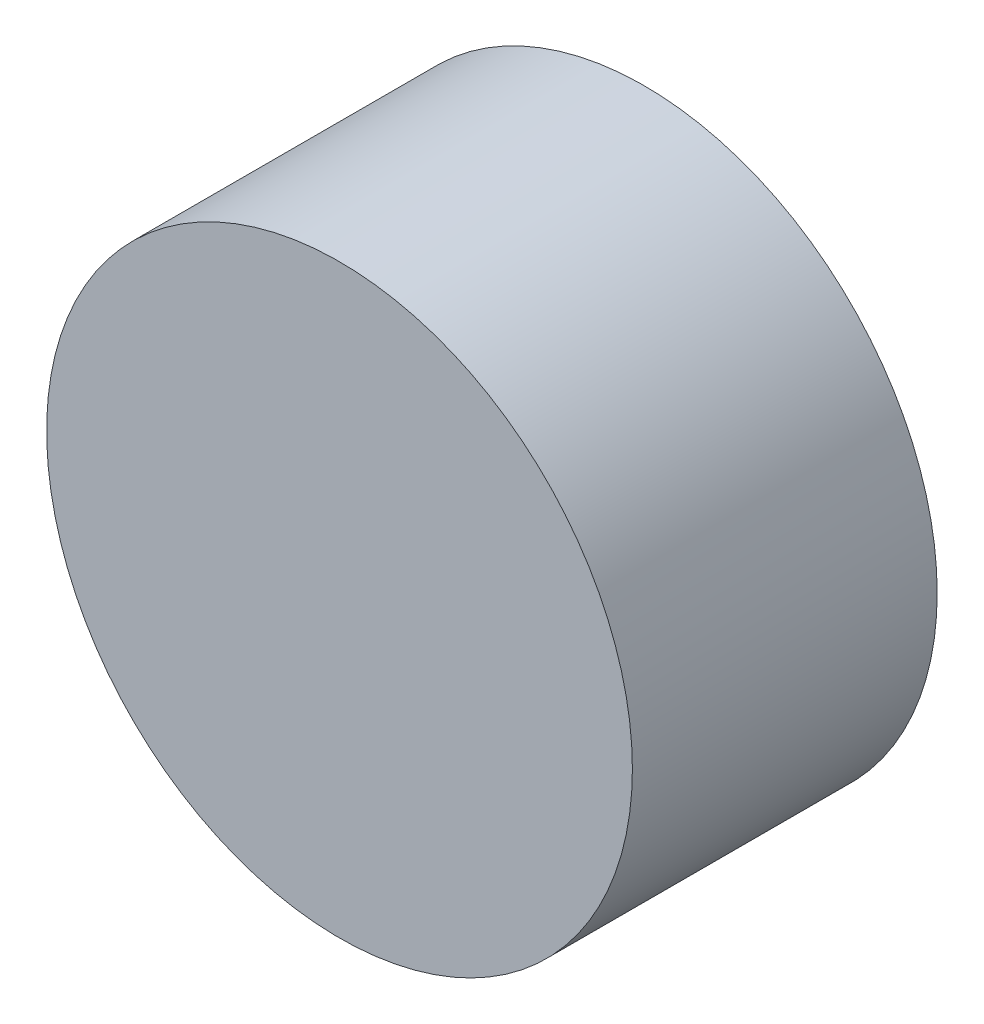
ISO-10303-21;
HEADER;
FILE_DESCRIPTION(('STEP AP214'),'2;1');
FILE_NAME('part.step','',(''),(''),'','','');
FILE_SCHEMA(('AUTOMOTIVE_DESIGN { 1 0 10303 214 1 1 1 1 }'));
ENDSEC;
DATA;
#1=APPLICATION_CONTEXT('core data for automotive mechanical design processes');
#2=APPLICATION_PROTOCOL_DEFINITION('international standard','automotive_design',2000,#1);
#3=PRODUCT_CONTEXT('',#1,'mechanical');
#4=PRODUCT('Part','Part','',(#3));
#5=PRODUCT_RELATED_PRODUCT_CATEGORY('part','',(#4));
#6=PRODUCT_DEFINITION_FORMATION('','',#4);
#7=PRODUCT_DEFINITION_CONTEXT('part definition',#1,'design');
#8=PRODUCT_DEFINITION('design','',#6,#7);
#9=PRODUCT_DEFINITION_SHAPE('','',#8);
#10=(LENGTH_UNIT() NAMED_UNIT(*) SI_UNIT(.MILLI.,.METRE.));
#11=(NAMED_UNIT(*) PLANE_ANGLE_UNIT() SI_UNIT($,.RADIAN.));
#12=(NAMED_UNIT(*) SI_UNIT($,.STERADIAN.) SOLID_ANGLE_UNIT());
#13=UNCERTAINTY_MEASURE_WITH_UNIT(LENGTH_MEASURE(1.E-05),#10,'distance_accuracy_value','');
#14=(GEOMETRIC_REPRESENTATION_CONTEXT(3) GLOBAL_UNCERTAINTY_ASSIGNED_CONTEXT((#13)) GLOBAL_UNIT_ASSIGNED_CONTEXT((#10,
#11,#12)) REPRESENTATION_CONTEXT('',''));
#15=CARTESIAN_POINT('',(0.,0.,0.));
#16=DIRECTION('',(0.,0.,1.));
#17=DIRECTION('',(1.,0.,0.));
#18=AXIS2_PLACEMENT_3D('',#15,#16,#17);
#19=CARTESIAN_POINT('',(-1.56448458955531E-13,-24.8501013000089,1125.82515195));
#20=DIRECTION('',(0.,0.,-1.));
#21=DIRECTION('',(0.,1.,0.));
#22=AXIS2_PLACEMENT_3D('',#19,#20,#21);
#23=PLANE('',#22);
#24=CARTESIAN_POINT('',(-1.56448458955531E-13,-24.8501013000089,1125.82515195));
#25=DIRECTION('',(0.,0.,-1.));
#26=DIRECTION('',(-1.,0.,0.));
#27=AXIS2_PLACEMENT_3D('',#24,#25,#26);
#28=CIRCLE('',#27,30.75);
#29=CARTESIAN_POINT('',(30.75,-24.8501013000086,1125.82515195));
#30=VERTEX_POINT('',#29);
#31=EDGE_CURVE('E11',#30,#30,#28,.T.);
#32=ORIENTED_EDGE('',*,*,#31,.F.);
#33=EDGE_LOOP('',(#32));
#34=FACE_BOUND('',#33,.T.);
#35=ADVANCED_FACE('F17',(#34),#23,.F.);
#36=CARTESIAN_POINT('',(-1.46637866874652E-13,-24.8501013000089,1093.82515195));
#37=DIRECTION('',(0.,0.,-1.));
#38=DIRECTION('',(0.,1.,0.));
#39=AXIS2_PLACEMENT_3D('',#36,#37,#38);
#40=PLANE('',#39);
#41=CARTESIAN_POINT('',(-1.46637866874652E-13,-24.8501013000089,1093.82515195));
#42=DIRECTION('',(0.,0.,-1.));
#43=DIRECTION('',(-1.,0.,0.));
#44=AXIS2_PLACEMENT_3D('',#41,#42,#43);
#45=CIRCLE('',#44,30.75);
#46=CARTESIAN_POINT('',(30.75,-24.8501013000086,1093.82515195));
#47=VERTEX_POINT('',#46);
#48=EDGE_CURVE('E20',#47,#47,#45,.T.);
#49=ORIENTED_EDGE('',*,*,#48,.T.);
#50=EDGE_LOOP('',(#49));
#51=FACE_BOUND('',#50,.T.);
#52=ADVANCED_FACE('F41',(#51),#40,.T.);
#53=CARTESIAN_POINT('',(-1.46637866874652E-13,-24.8501013000089,1093.82515195));
#54=DIRECTION('',(0.,0.,1.));
#55=DIRECTION('',(1.,0.,0.));
#56=AXIS2_PLACEMENT_3D('',#53,#54,#55);
#57=CYLINDRICAL_SURFACE('',#56,30.75);
#58=ORIENTED_EDGE('',*,*,#31,.T.);
#59=EDGE_LOOP('',(#58));
#60=FACE_BOUND('',#59,.T.);
#61=ORIENTED_EDGE('',*,*,#48,.F.);
#62=EDGE_LOOP('',(#61));
#63=FACE_BOUND('',#62,.T.);
#64=ADVANCED_FACE('F54',(#60,#63),#57,.T.);
#65=CLOSED_SHELL('',(#35,#52,#64));
#66=MANIFOLD_SOLID_BREP('B1',#65);
#67=ADVANCED_BREP_SHAPE_REPRESENTATION('',(#18,#66),#14);
#68=SHAPE_DEFINITION_REPRESENTATION(#9,#67);
ENDSEC;
END-ISO-10303-21;
